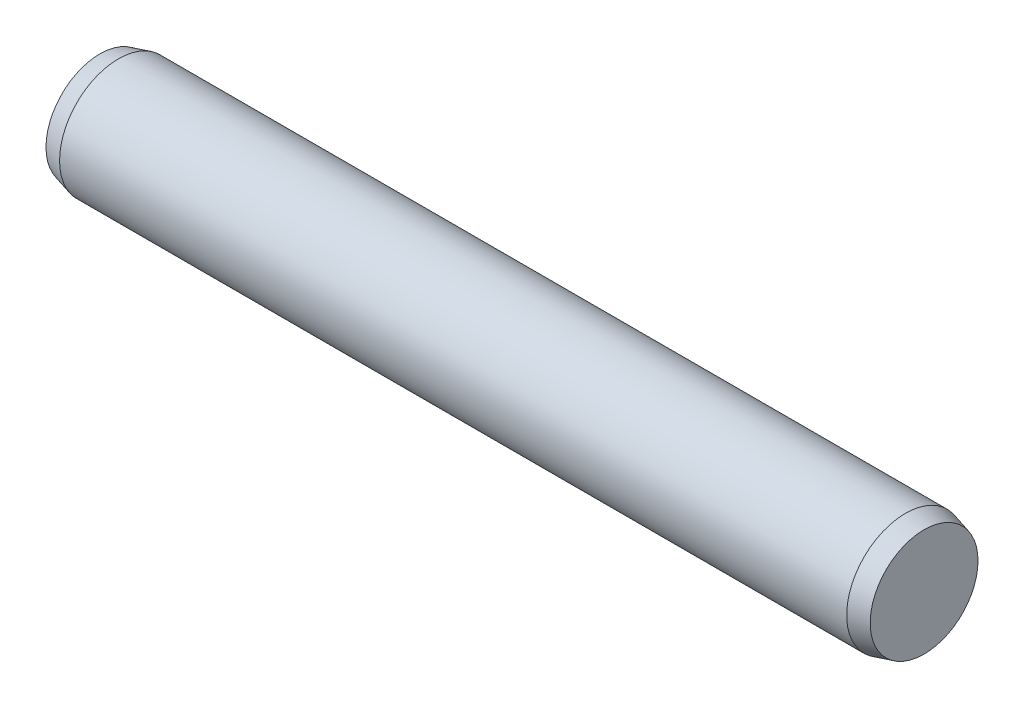
ISO-10303-21;
HEADER;
FILE_DESCRIPTION(('STEP AP214'),'2;1');
FILE_NAME('part.step','',(''),(''),'','','');
FILE_SCHEMA(('AUTOMOTIVE_DESIGN { 1 0 10303 214 1 1 1 1 }'));
ENDSEC;
DATA;
#1=APPLICATION_CONTEXT('core data for automotive mechanical design processes');
#2=APPLICATION_PROTOCOL_DEFINITION('international standard','automotive_design',2000,#1);
#3=PRODUCT_CONTEXT('',#1,'mechanical');
#4=PRODUCT('Part','Part','',(#3));
#5=PRODUCT_RELATED_PRODUCT_CATEGORY('part','',(#4));
#6=PRODUCT_DEFINITION_FORMATION('','',#4);
#7=PRODUCT_DEFINITION_CONTEXT('part definition',#1,'design');
#8=PRODUCT_DEFINITION('design','',#6,#7);
#9=PRODUCT_DEFINITION_SHAPE('','',#8);
#10=(LENGTH_UNIT() NAMED_UNIT(*) SI_UNIT(.MILLI.,.METRE.));
#11=(NAMED_UNIT(*) PLANE_ANGLE_UNIT() SI_UNIT($,.RADIAN.));
#12=(NAMED_UNIT(*) SI_UNIT($,.STERADIAN.) SOLID_ANGLE_UNIT());
#13=UNCERTAINTY_MEASURE_WITH_UNIT(LENGTH_MEASURE(1.E-05),#10,'distance_accuracy_value','');
#14=(GEOMETRIC_REPRESENTATION_CONTEXT(3) GLOBAL_UNCERTAINTY_ASSIGNED_CONTEXT((#13)) GLOBAL_UNIT_ASSIGNED_CONTEXT((#10,
#11,#12)) REPRESENTATION_CONTEXT('',''));
#15=CARTESIAN_POINT('',(0.,0.,0.));
#16=DIRECTION('',(0.,0.,1.));
#17=DIRECTION('',(1.,0.,0.));
#18=AXIS2_PLACEMENT_3D('',#15,#16,#17);
#19=CARTESIAN_POINT('',(-13.37,0.,0.));
#20=DIRECTION('',(1.,0.,0.));
#21=DIRECTION('',(0.,0.,-1.));
#22=AXIS2_PLACEMENT_3D('',#19,#20,#21);
#23=CYLINDRICAL_SURFACE('',#22,2.);
#24=CARTESIAN_POINT('',(-13.37,0.,0.));
#25=DIRECTION('',(-1.,0.,0.));
#26=DIRECTION('',(0.,0.,1.));
#27=AXIS2_PLACEMENT_3D('',#24,#25,#26);
#28=CIRCLE('',#27,2.);
#29=CARTESIAN_POINT('',(-13.37,0.,2.));
#30=VERTEX_POINT('',#29);
#31=EDGE_CURVE('E58',#30,#30,#28,.T.);
#32=ORIENTED_EDGE('',*,*,#31,.F.);
#33=EDGE_LOOP('',(#32));
#34=FACE_BOUND('',#33,.T.);
#35=CARTESIAN_POINT('',(13.37,0.,0.));
#36=DIRECTION('',(1.,0.,0.));
#37=DIRECTION('',(0.,0.,-1.));
#38=AXIS2_PLACEMENT_3D('',#35,#36,#37);
#39=CIRCLE('',#38,2.);
#40=CARTESIAN_POINT('',(13.37,0.,-2.));
#41=VERTEX_POINT('',#40);
#42=EDGE_CURVE('E10',#41,#41,#39,.T.);
#43=ORIENTED_EDGE('',*,*,#42,.F.);
#44=EDGE_LOOP('',(#43));
#45=FACE_BOUND('',#44,.T.);
#46=ADVANCED_FACE('F39',(#34,#45),#23,.T.);
#47=CARTESIAN_POINT('',(13.37,0.,0.));
#48=DIRECTION('',(-1.,0.,0.));
#49=DIRECTION('',(0.,0.,-1.));
#50=AXIS2_PLACEMENT_3D('',#47,#48,#49);
#51=CONICAL_SURFACE('',#50,2.,0.26179938779915);
#52=CARTESIAN_POINT('',(14.,0.,0.));
#53=DIRECTION('',(1.,0.,0.));
#54=DIRECTION('',(0.,0.,-1.));
#55=AXIS2_PLACEMENT_3D('',#52,#53,#54);
#56=CIRCLE('',#55,1.83119200876839);
#57=CARTESIAN_POINT('',(14.,0.,-1.83119200876839));
#58=VERTEX_POINT('',#57);
#59=EDGE_CURVE('E46',#58,#58,#56,.T.);
#60=ORIENTED_EDGE('',*,*,#59,.F.);
#61=EDGE_LOOP('',(#60));
#62=FACE_BOUND('',#61,.T.);
#63=ORIENTED_EDGE('',*,*,#42,.T.);
#64=EDGE_LOOP('',(#63));
#65=FACE_BOUND('',#64,.T.);
#66=ADVANCED_FACE('F70',(#62,#65),#51,.T.);
#67=CARTESIAN_POINT('',(14.,0.,0.));
#68=DIRECTION('',(1.,0.,0.));
#69=DIRECTION('',(0.,0.,-1.));
#70=AXIS2_PLACEMENT_3D('',#67,#68,#69);
#71=PLANE('',#70);
#72=ORIENTED_EDGE('',*,*,#59,.T.);
#73=EDGE_LOOP('',(#72));
#74=FACE_BOUND('',#73,.T.);
#75=ADVANCED_FACE('F74',(#74),#71,.T.);
#76=CARTESIAN_POINT('',(-13.37,0.,0.));
#77=DIRECTION('',(1.,0.,0.));
#78=DIRECTION('',(0.,0.,1.));
#79=AXIS2_PLACEMENT_3D('',#76,#77,#78);
#80=CONICAL_SURFACE('',#79,2.,0.26179938779915);
#81=CARTESIAN_POINT('',(-14.,0.,0.));
#82=DIRECTION('',(-1.,0.,0.));
#83=DIRECTION('',(0.,0.,1.));
#84=AXIS2_PLACEMENT_3D('',#81,#82,#83);
#85=CIRCLE('',#84,1.83119200876839);
#86=CARTESIAN_POINT('',(-14.,0.,1.83119200876839));
#87=VERTEX_POINT('',#86);
#88=EDGE_CURVE('E52',#87,#87,#85,.T.);
#89=ORIENTED_EDGE('',*,*,#88,.F.);
#90=EDGE_LOOP('',(#89));
#91=FACE_BOUND('',#90,.T.);
#92=ORIENTED_EDGE('',*,*,#31,.T.);
#93=EDGE_LOOP('',(#92));
#94=FACE_BOUND('',#93,.T.);
#95=ADVANCED_FACE('F66',(#91,#94),#80,.T.);
#96=CARTESIAN_POINT('',(-14.,0.,0.));
#97=DIRECTION('',(-1.,0.,0.));
#98=DIRECTION('',(0.,0.,1.));
#99=AXIS2_PLACEMENT_3D('',#96,#97,#98);
#100=PLANE('',#99);
#101=ORIENTED_EDGE('',*,*,#88,.T.);
#102=EDGE_LOOP('',(#101));
#103=FACE_BOUND('',#102,.T.);
#104=ADVANCED_FACE('F83',(#103),#100,.T.);
#105=CLOSED_SHELL('',(#46,#66,#75,#95,#104));
#106=MANIFOLD_SOLID_BREP('B2',#105);
#107=ADVANCED_BREP_SHAPE_REPRESENTATION('',(#18,#106),#14);
#108=SHAPE_DEFINITION_REPRESENTATION(#9,#107);
ENDSEC;
END-ISO-10303-21;
